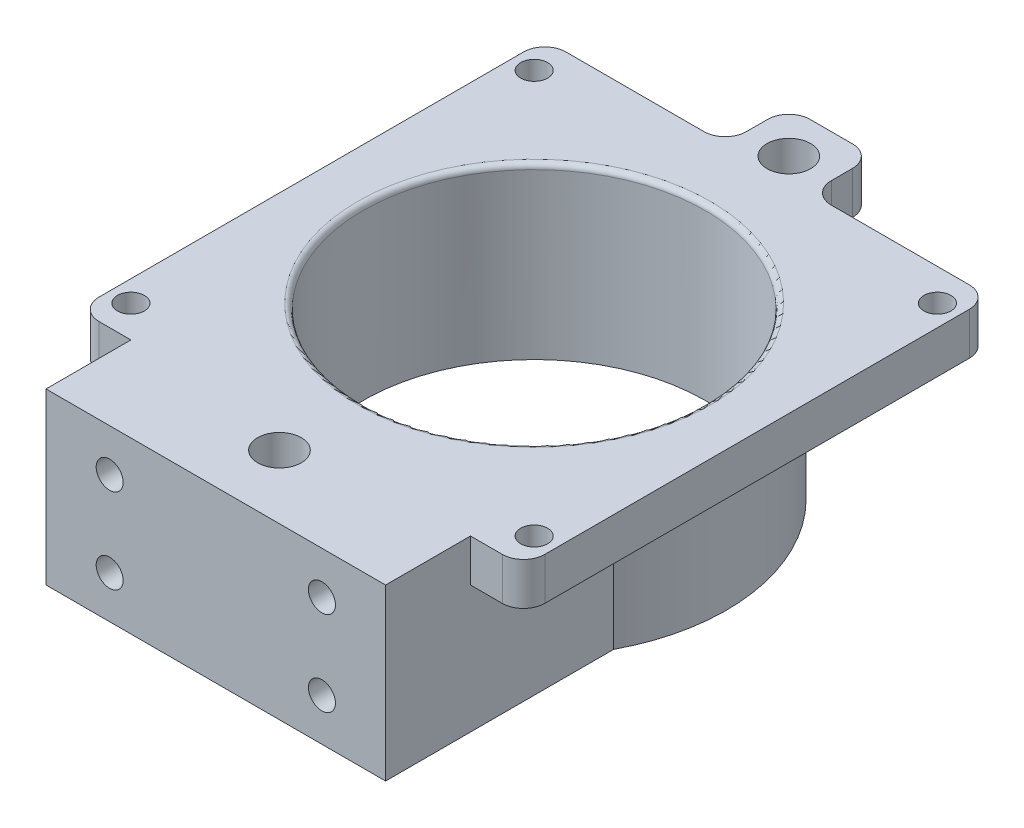
ISO-10303-21;
HEADER;
FILE_DESCRIPTION(('STEP AP214'),'2;1');
FILE_NAME('part.step','',(''),(''),'','','');
FILE_SCHEMA(('AUTOMOTIVE_DESIGN { 1 0 10303 214 1 1 1 1 }'));
ENDSEC;
DATA;
#1=APPLICATION_CONTEXT('core data for automotive mechanical design processes');
#2=APPLICATION_PROTOCOL_DEFINITION('international standard','automotive_design',2000,#1);
#3=PRODUCT_CONTEXT('',#1,'mechanical');
#4=PRODUCT('Part','Part','',(#3));
#5=PRODUCT_RELATED_PRODUCT_CATEGORY('part','',(#4));
#6=PRODUCT_DEFINITION_FORMATION('','',#4);
#7=PRODUCT_DEFINITION_CONTEXT('part definition',#1,'design');
#8=PRODUCT_DEFINITION('design','',#6,#7);
#9=PRODUCT_DEFINITION_SHAPE('','',#8);
#10=(LENGTH_UNIT() NAMED_UNIT(*) SI_UNIT(.MILLI.,.METRE.));
#11=(NAMED_UNIT(*) PLANE_ANGLE_UNIT() SI_UNIT($,.RADIAN.));
#12=(NAMED_UNIT(*) SI_UNIT($,.STERADIAN.) SOLID_ANGLE_UNIT());
#13=UNCERTAINTY_MEASURE_WITH_UNIT(LENGTH_MEASURE(1.E-05),#10,'distance_accuracy_value','');
#14=(GEOMETRIC_REPRESENTATION_CONTEXT(3) GLOBAL_UNCERTAINTY_ASSIGNED_CONTEXT((#13)) GLOBAL_UNIT_ASSIGNED_CONTEXT((#10,
#11,#12)) REPRESENTATION_CONTEXT('',''));
#15=CARTESIAN_POINT('',(0.,0.,0.));
#16=DIRECTION('',(0.,0.,1.));
#17=DIRECTION('',(1.,0.,0.));
#18=AXIS2_PLACEMENT_3D('',#15,#16,#17);
#19=CARTESIAN_POINT('',(25.4,0.,9.525));
#20=DIRECTION('',(1.,0.,0.));
#21=DIRECTION('',(0.,0.,-1.));
#22=AXIS2_PLACEMENT_3D('',#19,#20,#21);
#23=PLANE('',#22);
#24=DIRECTION('',(0.,0.,1.));
#25=VECTOR('',#24,1.);
#26=CARTESIAN_POINT('',(25.4,19.05,9.525));
#27=LINE('',#26,#25);
#28=CARTESIAN_POINT('',(25.4,19.05,13.501629170215));
#29=VERTEX_POINT('',#28);
#30=CARTESIAN_POINT('',(25.4,19.05,34.925));
#31=VERTEX_POINT('',#30);
#32=EDGE_CURVE('E394',#29,#31,#27,.T.);
#33=ORIENTED_EDGE('',*,*,#32,.T.);
#34=DIRECTION('',(0.,1.,0.));
#35=VECTOR('',#34,1.);
#36=CARTESIAN_POINT('',(25.4,0.,34.925));
#37=LINE('',#36,#35);
#38=CARTESIAN_POINT('',(25.4,25.4,34.925));
#39=VERTEX_POINT('',#38);
#40=EDGE_CURVE('E400',#31,#39,#37,.T.);
#41=ORIENTED_EDGE('',*,*,#40,.T.);
#42=DIRECTION('',(0.,0.,1.));
#43=VECTOR('',#42,1.);
#44=CARTESIAN_POINT('',(25.4,25.4,9.525));
#45=LINE('',#44,#43);
#46=CARTESIAN_POINT('',(25.4,25.4,47.625));
#47=VERTEX_POINT('',#46);
#48=EDGE_CURVE('E415',#39,#47,#45,.T.);
#49=ORIENTED_EDGE('',*,*,#48,.T.);
#50=DIRECTION('',(0.,1.,0.));
#51=VECTOR('',#50,1.);
#52=CARTESIAN_POINT('',(25.4,0.,47.625));
#53=LINE('',#52,#51);
#54=CARTESIAN_POINT('',(25.4,0.,47.625));
#55=VERTEX_POINT('',#54);
#56=EDGE_CURVE('E403',#55,#47,#53,.T.);
#57=ORIENTED_EDGE('',*,*,#56,.F.);
#58=DIRECTION('',(0.,0.,1.));
#59=VECTOR('',#58,1.);
#60=CARTESIAN_POINT('',(25.4,0.,9.525));
#61=LINE('',#60,#59);
#62=CARTESIAN_POINT('',(25.4,0.,13.501629170215));
#63=VERTEX_POINT('',#62);
#64=EDGE_CURVE('E50',#63,#55,#61,.T.);
#65=ORIENTED_EDGE('',*,*,#64,.F.);
#66=DIRECTION('',(0.,-1.,0.));
#67=VECTOR('',#66,1.);
#68=CARTESIAN_POINT('',(25.4,19.05,13.501629170215));
#69=LINE('',#68,#67);
#70=EDGE_CURVE('E423',#29,#63,#69,.T.);
#71=ORIENTED_EDGE('',*,*,#70,.F.);
#72=EDGE_LOOP('',(#33,#41,#49,#57,#65,#71));
#73=FACE_BOUND('',#72,.T.);
#74=ADVANCED_FACE('F35',(#73),#23,.T.);
#75=CARTESIAN_POINT('',(-25.4,0.,9.525));
#76=DIRECTION('',(-1.,0.,0.));
#77=DIRECTION('',(0.,0.,1.));
#78=AXIS2_PLACEMENT_3D('',#75,#76,#77);
#79=PLANE('',#78);
#80=DIRECTION('',(0.,0.,1.));
#81=VECTOR('',#80,1.);
#82=CARTESIAN_POINT('',(-25.4,25.4,9.525));
#83=LINE('',#82,#81);
#84=CARTESIAN_POINT('',(-25.4,25.4,34.925));
#85=VERTEX_POINT('',#84);
#86=CARTESIAN_POINT('',(-25.4,25.4,47.625));
#87=VERTEX_POINT('',#86);
#88=EDGE_CURVE('E419',#85,#87,#83,.T.);
#89=ORIENTED_EDGE('',*,*,#88,.F.);
#90=DIRECTION('',(0.,-1.,0.));
#91=VECTOR('',#90,1.);
#92=CARTESIAN_POINT('',(-25.4,0.,34.925));
#93=LINE('',#92,#91);
#94=CARTESIAN_POINT('',(-25.4,19.05,34.925));
#95=VERTEX_POINT('',#94);
#96=EDGE_CURVE('E397',#85,#95,#93,.T.);
#97=ORIENTED_EDGE('',*,*,#96,.T.);
#98=DIRECTION('',(0.,0.,-1.));
#99=VECTOR('',#98,1.);
#100=CARTESIAN_POINT('',(-25.4,19.05,9.525));
#101=LINE('',#100,#99);
#102=CARTESIAN_POINT('',(-25.4,19.05,13.501629170215));
#103=VERTEX_POINT('',#102);
#104=EDGE_CURVE('E392',#95,#103,#101,.T.);
#105=ORIENTED_EDGE('',*,*,#104,.T.);
#106=DIRECTION('',(0.,-1.,0.));
#107=VECTOR('',#106,1.);
#108=CARTESIAN_POINT('',(-25.4,19.05,13.501629170215));
#109=LINE('',#108,#107);
#110=CARTESIAN_POINT('',(-25.4,0.,13.501629170215));
#111=VERTEX_POINT('',#110);
#112=EDGE_CURVE('E58',#111,#103,#109,.F.);
#113=ORIENTED_EDGE('',*,*,#112,.F.);
#114=DIRECTION('',(0.,0.,1.));
#115=VECTOR('',#114,1.);
#116=CARTESIAN_POINT('',(-25.4,0.,9.525));
#117=LINE('',#116,#115);
#118=CARTESIAN_POINT('',(-25.4,0.,47.625));
#119=VERTEX_POINT('',#118);
#120=EDGE_CURVE('E417',#111,#119,#117,.T.);
#121=ORIENTED_EDGE('',*,*,#120,.T.);
#122=DIRECTION('',(0.,-1.,0.));
#123=VECTOR('',#122,1.);
#124=CARTESIAN_POINT('',(-25.4,0.,47.625));
#125=LINE('',#124,#123);
#126=EDGE_CURVE('E409',#87,#119,#125,.T.);
#127=ORIENTED_EDGE('',*,*,#126,.F.);
#128=EDGE_LOOP('',(#89,#97,#105,#113,#121,#127));
#129=FACE_BOUND('',#128,.T.);
#130=ADVANCED_FACE('F449',(#129),#79,.T.);
#131=CARTESIAN_POINT('',(0.,19.05,0.));
#132=DIRECTION('',(0.,-1.,0.));
#133=DIRECTION('',(0.,0.,-1.));
#134=AXIS2_PLACEMENT_3D('',#131,#132,#133);
#135=CYLINDRICAL_SURFACE('',#134,28.7655);
#136=CARTESIAN_POINT('',(0.,19.05,0.));
#137=DIRECTION('',(0.,1.,0.));
#138=DIRECTION('',(0.,0.,1.));
#139=AXIS2_PLACEMENT_3D('',#136,#137,#138);
#140=CIRCLE('',#139,28.7655);
#141=EDGE_CURVE('E426',#29,#103,#140,.T.);
#142=ORIENTED_EDGE('',*,*,#141,.F.);
#143=ORIENTED_EDGE('',*,*,#70,.T.);
#144=CARTESIAN_POINT('',(0.,0.,0.));
#145=DIRECTION('',(0.,1.,0.));
#146=DIRECTION('',(0.,0.,1.));
#147=AXIS2_PLACEMENT_3D('',#144,#145,#146);
#148=CIRCLE('',#147,28.7655);
#149=EDGE_CURVE('E425',#63,#111,#148,.T.);
#150=ORIENTED_EDGE('',*,*,#149,.T.);
#151=ORIENTED_EDGE('',*,*,#112,.T.);
#152=EDGE_LOOP('',(#142,#143,#150,#151));
#153=FACE_BOUND('',#152,.T.);
#154=ADVANCED_FACE('F454',(#153),#135,.T.);
#155=CARTESIAN_POINT('',(0.,0.,0.));
#156=DIRECTION('',(0.,1.,0.));
#157=DIRECTION('',(0.,0.,1.));
#158=AXIS2_PLACEMENT_3D('',#155,#156,#157);
#159=PLANE('',#158);
#160=CARTESIAN_POINT('',(0.,0.,38.1));
#161=DIRECTION('',(0.,1.,0.));
#162=DIRECTION('',(0.,0.,1.));
#163=AXIS2_PLACEMENT_3D('',#160,#161,#162);
#164=CIRCLE('',#163,3.2639);
#165=CARTESIAN_POINT('',(0.,0.,41.3639));
#166=VERTEX_POINT('',#165);
#167=EDGE_CURVE('E238',#166,#166,#164,.T.);
#168=ORIENTED_EDGE('',*,*,#167,.T.);
#169=EDGE_LOOP('',(#168));
#170=FACE_BOUND('',#169,.T.);
#171=CARTESIAN_POINT('',(0.,0.,0.));
#172=DIRECTION('',(0.,1.,0.));
#173=DIRECTION('',(0.,0.,1.));
#174=AXIS2_PLACEMENT_3D('',#171,#172,#173);
#175=CIRCLE('',#174,25.5905);
#176=CARTESIAN_POINT('',(0.,0.,25.5905));
#177=VERTEX_POINT('',#176);
#178=EDGE_CURVE('E265',#177,#177,#175,.T.);
#179=ORIENTED_EDGE('',*,*,#178,.T.);
#180=EDGE_LOOP('',(#179));
#181=FACE_BOUND('',#180,.T.);
#182=ORIENTED_EDGE('',*,*,#149,.F.);
#183=ORIENTED_EDGE('',*,*,#64,.T.);
#184=DIRECTION('',(1.,0.,0.));
#185=VECTOR('',#184,1.);
#186=CARTESIAN_POINT('',(25.4,0.,47.625));
#187=LINE('',#186,#185);
#188=EDGE_CURVE('E412',#119,#55,#187,.T.);
#189=ORIENTED_EDGE('',*,*,#188,.F.);
#190=ORIENTED_EDGE('',*,*,#120,.F.);
#191=EDGE_LOOP('',(#182,#183,#189,#190));
#192=FACE_BOUND('',#191,.T.);
#193=ADVANCED_FACE('F459',(#170,#181,#192),#159,.F.);
#194=CARTESIAN_POINT('',(25.4,25.4,9.525));
#195=DIRECTION('',(0.,1.,0.));
#196=DIRECTION('',(-1.,0.,0.));
#197=AXIS2_PLACEMENT_3D('',#194,#195,#196);
#198=PLANE('',#197);
#199=CARTESIAN_POINT('',(0.,25.4,-38.1));
#200=DIRECTION('',(0.,1.,0.));
#201=DIRECTION('',(0.,0.,1.));
#202=AXIS2_PLACEMENT_3D('',#199,#200,#201);
#203=CIRCLE('',#202,3.2639);
#204=CARTESIAN_POINT('',(0.,25.4,-34.8361));
#205=VERTEX_POINT('',#204);
#206=EDGE_CURVE('E229',#205,#205,#203,.T.);
#207=ORIENTED_EDGE('',*,*,#206,.F.);
#208=EDGE_LOOP('',(#207));
#209=FACE_BOUND('',#208,.T.);
#210=CARTESIAN_POINT('',(0.,25.4,38.1));
#211=DIRECTION('',(0.,1.,0.));
#212=DIRECTION('',(0.,0.,1.));
#213=AXIS2_PLACEMENT_3D('',#210,#211,#212);
#214=CIRCLE('',#213,3.2639);
#215=CARTESIAN_POINT('',(0.,25.4,41.3639));
#216=VERTEX_POINT('',#215);
#217=EDGE_CURVE('E235',#216,#216,#214,.T.);
#218=ORIENTED_EDGE('',*,*,#217,.F.);
#219=EDGE_LOOP('',(#218));
#220=FACE_BOUND('',#219,.T.);
#221=CARTESIAN_POINT('',(-30.1625,25.4,-30.1625));
#222=DIRECTION('',(0.,1.,0.));
#223=DIRECTION('',(0.,0.,1.));
#224=AXIS2_PLACEMENT_3D('',#221,#222,#223);
#225=CIRCLE('',#224,2.0193);
#226=CARTESIAN_POINT('',(-30.1625,25.4,-28.1432));
#227=VERTEX_POINT('',#226);
#228=EDGE_CURVE('E241',#227,#227,#225,.T.);
#229=ORIENTED_EDGE('',*,*,#228,.F.);
#230=EDGE_LOOP('',(#229));
#231=FACE_BOUND('',#230,.T.);
#232=CARTESIAN_POINT('',(30.1625,25.4,-30.1625));
#233=DIRECTION('',(0.,1.,0.));
#234=DIRECTION('',(0.,0.,1.));
#235=AXIS2_PLACEMENT_3D('',#232,#233,#234);
#236=CIRCLE('',#235,2.0193);
#237=CARTESIAN_POINT('',(30.1625,25.4,-28.1432));
#238=VERTEX_POINT('',#237);
#239=EDGE_CURVE('E247',#238,#238,#236,.T.);
#240=ORIENTED_EDGE('',*,*,#239,.F.);
#241=EDGE_LOOP('',(#240));
#242=FACE_BOUND('',#241,.T.);
#243=CARTESIAN_POINT('',(30.1625,25.4,30.1625));
#244=DIRECTION('',(0.,1.,0.));
#245=DIRECTION('',(0.,0.,1.));
#246=AXIS2_PLACEMENT_3D('',#243,#244,#245);
#247=CIRCLE('',#246,2.0193);
#248=CARTESIAN_POINT('',(30.1625,25.4,32.1818));
#249=VERTEX_POINT('',#248);
#250=EDGE_CURVE('E253',#249,#249,#247,.T.);
#251=ORIENTED_EDGE('',*,*,#250,.F.);
#252=EDGE_LOOP('',(#251));
#253=FACE_BOUND('',#252,.T.);
#254=CARTESIAN_POINT('',(-30.1625,25.4,30.1625));
#255=DIRECTION('',(0.,1.,0.));
#256=DIRECTION('',(0.,0.,1.));
#257=AXIS2_PLACEMENT_3D('',#254,#255,#256);
#258=CIRCLE('',#257,2.0193);
#259=CARTESIAN_POINT('',(-30.1625,25.4,32.1818));
#260=VERTEX_POINT('',#259);
#261=EDGE_CURVE('E259',#260,#260,#258,.T.);
#262=ORIENTED_EDGE('',*,*,#261,.F.);
#263=EDGE_LOOP('',(#262));
#264=FACE_BOUND('',#263,.T.);
#265=CARTESIAN_POINT('',(0.,25.4,0.));
#266=DIRECTION('',(0.,1.,0.));
#267=DIRECTION('',(-1.,0.,0.));
#268=AXIS2_PLACEMENT_3D('',#265,#266,#267);
#269=CIRCLE('',#268,26.38425);
#270=CARTESIAN_POINT('',(-26.38425,25.4,0.));
#271=VERTEX_POINT('',#270);
#272=EDGE_CURVE('E11',#271,#271,#269,.F.);
#273=ORIENTED_EDGE('',*,*,#272,.T.);
#274=EDGE_LOOP('',(#273));
#275=FACE_BOUND('',#274,.T.);
#276=ORIENTED_EDGE('',*,*,#48,.F.);
#277=DIRECTION('',(1.,0.,0.));
#278=VECTOR('',#277,1.);
#279=CARTESIAN_POINT('',(-33.3375,25.4,34.925));
#280=LINE('',#279,#278);
#281=CARTESIAN_POINT('',(30.1625,25.4,34.925));
#282=VERTEX_POINT('',#281);
#283=EDGE_CURVE('E291',#39,#282,#280,.T.);
#284=ORIENTED_EDGE('',*,*,#283,.T.);
#285=CARTESIAN_POINT('',(30.1625,25.4,31.75));
#286=DIRECTION('',(0.,1.,0.));
#287=DIRECTION('',(0.,0.,1.));
#288=AXIS2_PLACEMENT_3D('',#285,#286,#287);
#289=CIRCLE('',#288,3.175);
#290=CARTESIAN_POINT('',(33.3375,25.4,31.75));
#291=VERTEX_POINT('',#290);
#292=EDGE_CURVE('E350',#282,#291,#289,.T.);
#293=ORIENTED_EDGE('',*,*,#292,.T.);
#294=DIRECTION('',(0.,0.,-1.));
#295=VECTOR('',#294,1.);
#296=CARTESIAN_POINT('',(33.3375,25.4,-34.925));
#297=LINE('',#296,#295);
#298=CARTESIAN_POINT('',(33.3375,25.4,-31.75));
#299=VERTEX_POINT('',#298);
#300=EDGE_CURVE('E269',#291,#299,#297,.T.);
#301=ORIENTED_EDGE('',*,*,#300,.T.);
#302=CARTESIAN_POINT('',(30.1625,25.4,-31.75));
#303=DIRECTION('',(0.,1.,0.));
#304=DIRECTION('',(0.,0.,1.));
#305=AXIS2_PLACEMENT_3D('',#302,#303,#304);
#306=CIRCLE('',#305,3.175);
#307=CARTESIAN_POINT('',(30.1625,25.4,-34.925));
#308=VERTEX_POINT('',#307);
#309=EDGE_CURVE('E348',#299,#308,#306,.T.);
#310=ORIENTED_EDGE('',*,*,#309,.T.);
#311=DIRECTION('',(-1.,0.,0.));
#312=VECTOR('',#311,1.);
#313=CARTESIAN_POINT('',(6.35,25.4,-34.925));
#314=LINE('',#313,#312);
#315=CARTESIAN_POINT('',(9.525,25.4,-34.925));
#316=VERTEX_POINT('',#315);
#317=EDGE_CURVE('E272',#308,#316,#314,.T.);
#318=ORIENTED_EDGE('',*,*,#317,.T.);
#319=CARTESIAN_POINT('',(9.525,25.4,-38.1));
#320=DIRECTION('',(0.,1.,0.));
#321=DIRECTION('',(0.,0.,1.));
#322=AXIS2_PLACEMENT_3D('',#319,#320,#321);
#323=CIRCLE('',#322,3.175);
#324=CARTESIAN_POINT('',(6.35,25.4,-38.1));
#325=VERTEX_POINT('',#324);
#326=EDGE_CURVE('E386',#316,#325,#323,.F.);
#327=ORIENTED_EDGE('',*,*,#326,.T.);
#328=DIRECTION('',(0.,0.,-1.));
#329=VECTOR('',#328,1.);
#330=CARTESIAN_POINT('',(6.35,25.4,-44.45));
#331=LINE('',#330,#329);
#332=CARTESIAN_POINT('',(6.35,25.4,-41.275));
#333=VERTEX_POINT('',#332);
#334=EDGE_CURVE('E276',#325,#333,#331,.T.);
#335=ORIENTED_EDGE('',*,*,#334,.T.);
#336=CARTESIAN_POINT('',(3.175,25.4,-41.275));
#337=DIRECTION('',(0.,1.,0.));
#338=DIRECTION('',(0.,0.,1.));
#339=AXIS2_PLACEMENT_3D('',#336,#337,#338);
#340=CIRCLE('',#339,3.175);
#341=CARTESIAN_POINT('',(3.175,25.4,-44.45));
#342=VERTEX_POINT('',#341);
#343=EDGE_CURVE('E346',#333,#342,#340,.T.);
#344=ORIENTED_EDGE('',*,*,#343,.T.);
#345=DIRECTION('',(-1.,0.,0.));
#346=VECTOR('',#345,1.);
#347=CARTESIAN_POINT('',(-6.35,25.4,-44.45));
#348=LINE('',#347,#346);
#349=CARTESIAN_POINT('',(-3.175,25.4,-44.45));
#350=VERTEX_POINT('',#349);
#351=EDGE_CURVE('E279',#342,#350,#348,.T.);
#352=ORIENTED_EDGE('',*,*,#351,.T.);
#353=CARTESIAN_POINT('',(-3.175,25.4,-41.275));
#354=DIRECTION('',(0.,1.,0.));
#355=DIRECTION('',(0.,0.,1.));
#356=AXIS2_PLACEMENT_3D('',#353,#354,#355);
#357=CIRCLE('',#356,3.175);
#358=CARTESIAN_POINT('',(-6.35,25.4,-41.275));
#359=VERTEX_POINT('',#358);
#360=EDGE_CURVE('E344',#350,#359,#357,.T.);
#361=ORIENTED_EDGE('',*,*,#360,.T.);
#362=DIRECTION('',(0.,0.,1.));
#363=VECTOR('',#362,1.);
#364=CARTESIAN_POINT('',(-6.35,25.4,-44.45));
#365=LINE('',#364,#363);
#366=CARTESIAN_POINT('',(-6.35,25.4,-38.1));
#367=VERTEX_POINT('',#366);
#368=EDGE_CURVE('E282',#359,#367,#365,.T.);
#369=ORIENTED_EDGE('',*,*,#368,.T.);
#370=CARTESIAN_POINT('',(-9.525,25.4,-38.1));
#371=DIRECTION('',(0.,1.,0.));
#372=DIRECTION('',(0.,0.,1.));
#373=AXIS2_PLACEMENT_3D('',#370,#371,#372);
#374=CIRCLE('',#373,3.175);
#375=CARTESIAN_POINT('',(-9.525,25.4,-34.925));
#376=VERTEX_POINT('',#375);
#377=EDGE_CURVE('E390',#367,#376,#374,.F.);
#378=ORIENTED_EDGE('',*,*,#377,.T.);
#379=DIRECTION('',(-1.,0.,0.));
#380=VECTOR('',#379,1.);
#381=CARTESIAN_POINT('',(-33.3375,25.4,-34.925));
#382=LINE('',#381,#380);
#383=CARTESIAN_POINT('',(-30.1625,25.4,-34.925));
#384=VERTEX_POINT('',#383);
#385=EDGE_CURVE('E285',#376,#384,#382,.T.);
#386=ORIENTED_EDGE('',*,*,#385,.T.);
#387=CARTESIAN_POINT('',(-30.1625,25.4,-31.75));
#388=DIRECTION('',(0.,1.,0.));
#389=DIRECTION('',(0.,0.,1.));
#390=AXIS2_PLACEMENT_3D('',#387,#388,#389);
#391=CIRCLE('',#390,3.175);
#392=CARTESIAN_POINT('',(-33.3375,25.4,-31.75));
#393=VERTEX_POINT('',#392);
#394=EDGE_CURVE('E342',#384,#393,#391,.T.);
#395=ORIENTED_EDGE('',*,*,#394,.T.);
#396=DIRECTION('',(0.,0.,1.));
#397=VECTOR('',#396,1.);
#398=CARTESIAN_POINT('',(-33.3375,25.4,-34.925));
#399=LINE('',#398,#397);
#400=CARTESIAN_POINT('',(-33.3375,25.4,31.75));
#401=VERTEX_POINT('',#400);
#402=EDGE_CURVE('E288',#393,#401,#399,.T.);
#403=ORIENTED_EDGE('',*,*,#402,.T.);
#404=CARTESIAN_POINT('',(-30.1625,25.4,31.75));
#405=DIRECTION('',(0.,1.,0.));
#406=DIRECTION('',(0.,0.,1.));
#407=AXIS2_PLACEMENT_3D('',#404,#405,#406);
#408=CIRCLE('',#407,3.175);
#409=CARTESIAN_POINT('',(-30.1625,25.4,34.925));
#410=VERTEX_POINT('',#409);
#411=EDGE_CURVE('E352',#401,#410,#408,.T.);
#412=ORIENTED_EDGE('',*,*,#411,.T.);
#413=EDGE_CURVE('E292',#410,#85,#280,.T.);
#414=ORIENTED_EDGE('',*,*,#413,.T.);
#415=ORIENTED_EDGE('',*,*,#88,.T.);
#416=DIRECTION('',(-1.,0.,0.));
#417=VECTOR('',#416,1.);
#418=CARTESIAN_POINT('',(25.4,25.4,47.625));
#419=LINE('',#418,#417);
#420=EDGE_CURVE('E406',#47,#87,#419,.T.);
#421=ORIENTED_EDGE('',*,*,#420,.F.);
#422=EDGE_LOOP('',(#276,#284,#293,#301,#310,#318,#327,#335,#344,#352,#361,#369,#378,#386,#395,
#403,#412,#414,#415,#421));
#423=FACE_BOUND('',#422,.T.);
#424=ADVANCED_FACE('F458',(#209,#220,#231,#242,#253,#264,#275,#423),#198,.T.);
#425=CARTESIAN_POINT('',(0.,0.,47.625));
#426=DIRECTION('',(0.,0.,1.));
#427=DIRECTION('',(1.,0.,0.));
#428=AXIS2_PLACEMENT_3D('',#425,#426,#427);
#429=PLANE('',#428);
#430=CARTESIAN_POINT('',(-15.875,19.05,47.625));
#431=DIRECTION('',(0.,0.,1.));
#432=DIRECTION('',(1.,0.,0.));
#433=AXIS2_PLACEMENT_3D('',#430,#431,#432);
#434=CIRCLE('',#433,2.01929999999999);
#435=CARTESIAN_POINT('',(-13.8557,19.05,47.625));
#436=VERTEX_POINT('',#435);
#437=EDGE_CURVE('E207',#436,#436,#434,.T.);
#438=ORIENTED_EDGE('',*,*,#437,.F.);
#439=EDGE_LOOP('',(#438));
#440=FACE_BOUND('',#439,.T.);
#441=CARTESIAN_POINT('',(-15.875,6.35,47.625));
#442=DIRECTION('',(0.,0.,1.));
#443=DIRECTION('',(1.,0.,0.));
#444=AXIS2_PLACEMENT_3D('',#441,#442,#443);
#445=CIRCLE('',#444,2.01929999999999);
#446=CARTESIAN_POINT('',(-13.8557,6.35,47.625));
#447=VERTEX_POINT('',#446);
#448=EDGE_CURVE('E206',#447,#447,#445,.T.);
#449=ORIENTED_EDGE('',*,*,#448,.F.);
#450=EDGE_LOOP('',(#449));
#451=FACE_BOUND('',#450,.T.);
#452=CARTESIAN_POINT('',(15.875,6.35000000000001,47.625));
#453=DIRECTION('',(0.,0.,1.));
#454=DIRECTION('',(1.,0.,0.));
#455=AXIS2_PLACEMENT_3D('',#452,#453,#454);
#456=CIRCLE('',#455,2.01929999999999);
#457=CARTESIAN_POINT('',(17.8943,6.35000000000001,47.625));
#458=VERTEX_POINT('',#457);
#459=EDGE_CURVE('E217',#458,#458,#456,.T.);
#460=ORIENTED_EDGE('',*,*,#459,.F.);
#461=EDGE_LOOP('',(#460));
#462=FACE_BOUND('',#461,.T.);
#463=CARTESIAN_POINT('',(15.875,19.05,47.625));
#464=DIRECTION('',(0.,0.,1.));
#465=DIRECTION('',(1.,0.,0.));
#466=AXIS2_PLACEMENT_3D('',#463,#464,#465);
#467=CIRCLE('',#466,2.01929999999999);
#468=CARTESIAN_POINT('',(17.8943,19.05,47.625));
#469=VERTEX_POINT('',#468);
#470=EDGE_CURVE('E223',#469,#469,#467,.T.);
#471=ORIENTED_EDGE('',*,*,#470,.F.);
#472=EDGE_LOOP('',(#471));
#473=FACE_BOUND('',#472,.T.);
#474=ORIENTED_EDGE('',*,*,#56,.T.);
#475=ORIENTED_EDGE('',*,*,#420,.T.);
#476=ORIENTED_EDGE('',*,*,#126,.T.);
#477=ORIENTED_EDGE('',*,*,#188,.T.);
#478=EDGE_LOOP('',(#474,#475,#476,#477));
#479=FACE_BOUND('',#478,.T.);
#480=ADVANCED_FACE('F549',(#440,#451,#462,#473,#479),#429,.T.);
#481=CARTESIAN_POINT('',(-33.3375,25.4,34.925));
#482=DIRECTION('',(0.,0.,-1.));
#483=DIRECTION('',(-1.,0.,0.));
#484=AXIS2_PLACEMENT_3D('',#481,#482,#483);
#485=PLANE('',#484);
#486=ORIENTED_EDGE('',*,*,#40,.F.);
#487=DIRECTION('',(1.,0.,0.));
#488=VECTOR('',#487,1.);
#489=CARTESIAN_POINT('',(-33.3375,19.05,34.925));
#490=LINE('',#489,#488);
#491=CARTESIAN_POINT('',(30.1625,19.05,34.925));
#492=VERTEX_POINT('',#491);
#493=EDGE_CURVE('E316',#31,#492,#490,.T.);
#494=ORIENTED_EDGE('',*,*,#493,.T.);
#495=DIRECTION('',(0.,-1.,0.));
#496=VECTOR('',#495,1.);
#497=CARTESIAN_POINT('',(30.1625,25.4,34.925));
#498=LINE('',#497,#496);
#499=EDGE_CURVE('E295',#492,#282,#498,.F.);
#500=ORIENTED_EDGE('',*,*,#499,.T.);
#501=ORIENTED_EDGE('',*,*,#283,.F.);
#502=EDGE_LOOP('',(#486,#494,#500,#501));
#503=FACE_BOUND('',#502,.T.);
#504=ADVANCED_FACE('F553',(#503),#485,.F.);
#505=CARTESIAN_POINT('',(0.,19.05,0.));
#506=DIRECTION('',(0.,1.,0.));
#507=DIRECTION('',(0.,0.,1.));
#508=AXIS2_PLACEMENT_3D('',#505,#506,#507);
#509=PLANE('',#508);
#510=CARTESIAN_POINT('',(0.,19.05,-38.1));
#511=DIRECTION('',(0.,1.,0.));
#512=DIRECTION('',(0.,0.,1.));
#513=AXIS2_PLACEMENT_3D('',#510,#511,#512);
#514=CIRCLE('',#513,3.2639);
#515=CARTESIAN_POINT('',(0.,19.05,-34.8361));
#516=VERTEX_POINT('',#515);
#517=EDGE_CURVE('E232',#516,#516,#514,.T.);
#518=ORIENTED_EDGE('',*,*,#517,.T.);
#519=EDGE_LOOP('',(#518));
#520=FACE_BOUND('',#519,.T.);
#521=CARTESIAN_POINT('',(-30.1625,19.05,-30.1625));
#522=DIRECTION('',(0.,1.,0.));
#523=DIRECTION('',(0.,0.,1.));
#524=AXIS2_PLACEMENT_3D('',#521,#522,#523);
#525=CIRCLE('',#524,2.0193);
#526=CARTESIAN_POINT('',(-30.1625,19.05,-28.1432));
#527=VERTEX_POINT('',#526);
#528=EDGE_CURVE('E244',#527,#527,#525,.T.);
#529=ORIENTED_EDGE('',*,*,#528,.T.);
#530=EDGE_LOOP('',(#529));
#531=FACE_BOUND('',#530,.T.);
#532=CARTESIAN_POINT('',(30.1625,19.05,-30.1625));
#533=DIRECTION('',(0.,1.,0.));
#534=DIRECTION('',(0.,0.,1.));
#535=AXIS2_PLACEMENT_3D('',#532,#533,#534);
#536=CIRCLE('',#535,2.0193);
#537=CARTESIAN_POINT('',(30.1625,19.05,-28.1432));
#538=VERTEX_POINT('',#537);
#539=EDGE_CURVE('E250',#538,#538,#536,.T.);
#540=ORIENTED_EDGE('',*,*,#539,.T.);
#541=EDGE_LOOP('',(#540));
#542=FACE_BOUND('',#541,.T.);
#543=CARTESIAN_POINT('',(30.1625,19.05,30.1625));
#544=DIRECTION('',(0.,1.,0.));
#545=DIRECTION('',(0.,0.,1.));
#546=AXIS2_PLACEMENT_3D('',#543,#544,#545);
#547=CIRCLE('',#546,2.0193);
#548=CARTESIAN_POINT('',(30.1625,19.05,32.1818));
#549=VERTEX_POINT('',#548);
#550=EDGE_CURVE('E256',#549,#549,#547,.T.);
#551=ORIENTED_EDGE('',*,*,#550,.T.);
#552=EDGE_LOOP('',(#551));
#553=FACE_BOUND('',#552,.T.);
#554=CARTESIAN_POINT('',(-30.1625,19.05,30.1625));
#555=DIRECTION('',(0.,1.,0.));
#556=DIRECTION('',(0.,0.,1.));
#557=AXIS2_PLACEMENT_3D('',#554,#555,#556);
#558=CIRCLE('',#557,2.0193);
#559=CARTESIAN_POINT('',(-30.1625,19.05,32.1818));
#560=VERTEX_POINT('',#559);
#561=EDGE_CURVE('E262',#560,#560,#558,.T.);
#562=ORIENTED_EDGE('',*,*,#561,.T.);
#563=EDGE_LOOP('',(#562));
#564=FACE_BOUND('',#563,.T.);
#565=ORIENTED_EDGE('',*,*,#32,.F.);
#566=ORIENTED_EDGE('',*,*,#141,.T.);
#567=ORIENTED_EDGE('',*,*,#104,.F.);
#568=CARTESIAN_POINT('',(-30.1625,19.05,34.925));
#569=VERTEX_POINT('',#568);
#570=EDGE_CURVE('E273',#569,#95,#490,.T.);
#571=ORIENTED_EDGE('',*,*,#570,.F.);
#572=CARTESIAN_POINT('',(-30.1625,19.05,31.75));
#573=DIRECTION('',(0.,1.,0.));
#574=DIRECTION('',(0.,0.,1.));
#575=AXIS2_PLACEMENT_3D('',#572,#573,#574);
#576=CIRCLE('',#575,3.175);
#577=CARTESIAN_POINT('',(-33.3375,19.05,31.75));
#578=VERTEX_POINT('',#577);
#579=EDGE_CURVE('E335',#569,#578,#576,.F.);
#580=ORIENTED_EDGE('',*,*,#579,.T.);
#581=DIRECTION('',(0.,0.,1.));
#582=VECTOR('',#581,1.);
#583=CARTESIAN_POINT('',(-33.3375,19.05,-34.925));
#584=LINE('',#583,#582);
#585=CARTESIAN_POINT('',(-33.3375,19.05,-31.75));
#586=VERTEX_POINT('',#585);
#587=EDGE_CURVE('E313',#586,#578,#584,.T.);
#588=ORIENTED_EDGE('',*,*,#587,.F.);
#589=CARTESIAN_POINT('',(-30.1625,19.05,-31.75));
#590=DIRECTION('',(0.,1.,0.));
#591=DIRECTION('',(0.,0.,1.));
#592=AXIS2_PLACEMENT_3D('',#589,#590,#591);
#593=CIRCLE('',#592,3.175);
#594=CARTESIAN_POINT('',(-30.1625,19.05,-34.925));
#595=VERTEX_POINT('',#594);
#596=EDGE_CURVE('E324',#586,#595,#593,.F.);
#597=ORIENTED_EDGE('',*,*,#596,.T.);
#598=DIRECTION('',(-1.,0.,0.));
#599=VECTOR('',#598,1.);
#600=CARTESIAN_POINT('',(-33.3375,19.05,-34.925));
#601=LINE('',#600,#599);
#602=CARTESIAN_POINT('',(-9.525,19.05,-34.925));
#603=VERTEX_POINT('',#602);
#604=EDGE_CURVE('E310',#603,#595,#601,.T.);
#605=ORIENTED_EDGE('',*,*,#604,.F.);
#606=CARTESIAN_POINT('',(-9.525,19.05,-38.1));
#607=DIRECTION('',(0.,1.,0.));
#608=DIRECTION('',(0.,0.,1.));
#609=AXIS2_PLACEMENT_3D('',#606,#607,#608);
#610=CIRCLE('',#609,3.175);
#611=CARTESIAN_POINT('',(-6.35,19.05,-38.1));
#612=VERTEX_POINT('',#611);
#613=EDGE_CURVE('E388',#603,#612,#610,.T.);
#614=ORIENTED_EDGE('',*,*,#613,.T.);
#615=DIRECTION('',(0.,0.,1.));
#616=VECTOR('',#615,1.);
#617=CARTESIAN_POINT('',(-6.35,19.05,-44.45));
#618=LINE('',#617,#616);
#619=CARTESIAN_POINT('',(-6.35,19.05,-41.275));
#620=VERTEX_POINT('',#619);
#621=EDGE_CURVE('E307',#620,#612,#618,.T.);
#622=ORIENTED_EDGE('',*,*,#621,.F.);
#623=CARTESIAN_POINT('',(-3.175,19.05,-41.275));
#624=DIRECTION('',(0.,1.,0.));
#625=DIRECTION('',(0.,0.,1.));
#626=AXIS2_PLACEMENT_3D('',#623,#624,#625);
#627=CIRCLE('',#626,3.175);
#628=CARTESIAN_POINT('',(-3.175,19.05,-44.45));
#629=VERTEX_POINT('',#628);
#630=EDGE_CURVE('E326',#620,#629,#627,.F.);
#631=ORIENTED_EDGE('',*,*,#630,.T.);
#632=DIRECTION('',(-1.,0.,0.));
#633=VECTOR('',#632,1.);
#634=CARTESIAN_POINT('',(-6.35,19.05,-44.45));
#635=LINE('',#634,#633);
#636=CARTESIAN_POINT('',(3.175,19.05,-44.45));
#637=VERTEX_POINT('',#636);
#638=EDGE_CURVE('E304',#637,#629,#635,.T.);
#639=ORIENTED_EDGE('',*,*,#638,.F.);
#640=CARTESIAN_POINT('',(3.175,19.05,-41.275));
#641=DIRECTION('',(0.,1.,0.));
#642=DIRECTION('',(0.,0.,1.));
#643=AXIS2_PLACEMENT_3D('',#640,#641,#642);
#644=CIRCLE('',#643,3.175);
#645=CARTESIAN_POINT('',(6.35,19.05,-41.275));
#646=VERTEX_POINT('',#645);
#647=EDGE_CURVE('E328',#637,#646,#644,.F.);
#648=ORIENTED_EDGE('',*,*,#647,.T.);
#649=DIRECTION('',(0.,0.,-1.));
#650=VECTOR('',#649,1.);
#651=CARTESIAN_POINT('',(6.35,19.05,-44.45));
#652=LINE('',#651,#650);
#653=CARTESIAN_POINT('',(6.35,19.05,-38.1));
#654=VERTEX_POINT('',#653);
#655=EDGE_CURVE('E301',#654,#646,#652,.T.);
#656=ORIENTED_EDGE('',*,*,#655,.F.);
#657=CARTESIAN_POINT('',(9.525,19.05,-38.1));
#658=DIRECTION('',(0.,1.,0.));
#659=DIRECTION('',(0.,0.,1.));
#660=AXIS2_PLACEMENT_3D('',#657,#658,#659);
#661=CIRCLE('',#660,3.175);
#662=CARTESIAN_POINT('',(9.525,19.05,-34.925));
#663=VERTEX_POINT('',#662);
#664=EDGE_CURVE('E384',#654,#663,#661,.T.);
#665=ORIENTED_EDGE('',*,*,#664,.T.);
#666=DIRECTION('',(-1.,0.,0.));
#667=VECTOR('',#666,1.);
#668=CARTESIAN_POINT('',(6.35,19.05,-34.925));
#669=LINE('',#668,#667);
#670=CARTESIAN_POINT('',(30.1625,19.05,-34.925));
#671=VERTEX_POINT('',#670);
#672=EDGE_CURVE('E298',#671,#663,#669,.T.);
#673=ORIENTED_EDGE('',*,*,#672,.F.);
#674=CARTESIAN_POINT('',(30.1625,19.05,-31.75));
#675=DIRECTION('',(0.,1.,0.));
#676=DIRECTION('',(0.,0.,1.));
#677=AXIS2_PLACEMENT_3D('',#674,#675,#676);
#678=CIRCLE('',#677,3.175);
#679=CARTESIAN_POINT('',(33.3375,19.05,-31.75));
#680=VERTEX_POINT('',#679);
#681=EDGE_CURVE('E330',#671,#680,#678,.F.);
#682=ORIENTED_EDGE('',*,*,#681,.T.);
#683=DIRECTION('',(0.,0.,-1.));
#684=VECTOR('',#683,1.);
#685=CARTESIAN_POINT('',(33.3375,19.05,-34.925));
#686=LINE('',#685,#684);
#687=CARTESIAN_POINT('',(33.3375,19.05,31.75));
#688=VERTEX_POINT('',#687);
#689=EDGE_CURVE('E268',#688,#680,#686,.T.);
#690=ORIENTED_EDGE('',*,*,#689,.F.);
#691=CARTESIAN_POINT('',(30.1625,19.05,31.75));
#692=DIRECTION('',(0.,1.,0.));
#693=DIRECTION('',(0.,0.,1.));
#694=AXIS2_PLACEMENT_3D('',#691,#692,#693);
#695=CIRCLE('',#694,3.175);
#696=EDGE_CURVE('E332',#688,#492,#695,.F.);
#697=ORIENTED_EDGE('',*,*,#696,.T.);
#698=ORIENTED_EDGE('',*,*,#493,.F.);
#699=EDGE_LOOP('',(#565,#566,#567,#571,#580,#588,#597,#605,#614,#622,#631,#639,#648,#656,#665,
#673,#682,#690,#697,#698));
#700=FACE_BOUND('',#699,.T.);
#701=ADVANCED_FACE('F469',(#520,#531,#542,#553,#564,#700),#509,.F.);
#702=CARTESIAN_POINT('',(33.3375,25.4,-34.925));
#703=DIRECTION('',(-1.,0.,0.));
#704=DIRECTION('',(0.,0.,1.));
#705=AXIS2_PLACEMENT_3D('',#702,#703,#704);
#706=PLANE('',#705);
#707=ORIENTED_EDGE('',*,*,#300,.F.);
#708=DIRECTION('',(0.,-1.,0.));
#709=VECTOR('',#708,1.);
#710=CARTESIAN_POINT('',(33.3375,25.4,31.75));
#711=LINE('',#710,#709);
#712=EDGE_CURVE('E356',#291,#688,#711,.T.);
#713=ORIENTED_EDGE('',*,*,#712,.T.);
#714=ORIENTED_EDGE('',*,*,#689,.T.);
#715=DIRECTION('',(0.,-1.,0.));
#716=VECTOR('',#715,1.);
#717=CARTESIAN_POINT('',(33.3375,25.4,-31.75));
#718=LINE('',#717,#716);
#719=EDGE_CURVE('E354',#680,#299,#718,.F.);
#720=ORIENTED_EDGE('',*,*,#719,.T.);
#721=EDGE_LOOP('',(#707,#713,#714,#720));
#722=FACE_BOUND('',#721,.T.);
#723=ADVANCED_FACE('F541',(#722),#706,.F.);
#724=CARTESIAN_POINT('',(6.35,25.4,-34.925));
#725=DIRECTION('',(0.,0.,1.));
#726=DIRECTION('',(1.,0.,0.));
#727=AXIS2_PLACEMENT_3D('',#724,#725,#726);
#728=PLANE('',#727);
#729=ORIENTED_EDGE('',*,*,#317,.F.);
#730=DIRECTION('',(0.,-1.,0.));
#731=VECTOR('',#730,1.);
#732=CARTESIAN_POINT('',(30.1625,25.4,-34.925));
#733=LINE('',#732,#731);
#734=EDGE_CURVE('E361',#308,#671,#733,.T.);
#735=ORIENTED_EDGE('',*,*,#734,.T.);
#736=ORIENTED_EDGE('',*,*,#672,.T.);
#737=DIRECTION('',(0.,-1.,0.));
#738=VECTOR('',#737,1.);
#739=CARTESIAN_POINT('',(9.525,25.4,-34.925));
#740=LINE('',#739,#738);
#741=EDGE_CURVE('E359',#663,#316,#740,.F.);
#742=ORIENTED_EDGE('',*,*,#741,.T.);
#743=EDGE_LOOP('',(#729,#735,#736,#742));
#744=FACE_BOUND('',#743,.T.);
#745=ADVANCED_FACE('F532',(#744),#728,.F.);
#746=CARTESIAN_POINT('',(6.35,25.4,-44.45));
#747=DIRECTION('',(-1.,0.,0.));
#748=DIRECTION('',(0.,0.,1.));
#749=AXIS2_PLACEMENT_3D('',#746,#747,#748);
#750=PLANE('',#749);
#751=ORIENTED_EDGE('',*,*,#334,.F.);
#752=DIRECTION('',(0.,-1.,0.));
#753=VECTOR('',#752,1.);
#754=CARTESIAN_POINT('',(6.35,19.05,-38.1));
#755=LINE('',#754,#753);
#756=EDGE_CURVE('E366',#325,#654,#755,.T.);
#757=ORIENTED_EDGE('',*,*,#756,.T.);
#758=ORIENTED_EDGE('',*,*,#655,.T.);
#759=DIRECTION('',(0.,-1.,0.));
#760=VECTOR('',#759,1.);
#761=CARTESIAN_POINT('',(6.35,25.4,-41.275));
#762=LINE('',#761,#760);
#763=EDGE_CURVE('E364',#646,#333,#762,.F.);
#764=ORIENTED_EDGE('',*,*,#763,.T.);
#765=EDGE_LOOP('',(#751,#757,#758,#764));
#766=FACE_BOUND('',#765,.T.);
#767=ADVANCED_FACE('F523',(#766),#750,.F.);
#768=CARTESIAN_POINT('',(-6.35,25.4,-44.45));
#769=DIRECTION('',(0.,0.,1.));
#770=DIRECTION('',(1.,0.,0.));
#771=AXIS2_PLACEMENT_3D('',#768,#769,#770);
#772=PLANE('',#771);
#773=ORIENTED_EDGE('',*,*,#351,.F.);
#774=DIRECTION('',(0.,-1.,0.));
#775=VECTOR('',#774,1.);
#776=CARTESIAN_POINT('',(3.175,25.4,-44.45));
#777=LINE('',#776,#775);
#778=EDGE_CURVE('E371',#342,#637,#777,.T.);
#779=ORIENTED_EDGE('',*,*,#778,.T.);
#780=ORIENTED_EDGE('',*,*,#638,.T.);
#781=DIRECTION('',(0.,-1.,0.));
#782=VECTOR('',#781,1.);
#783=CARTESIAN_POINT('',(-3.175,25.4,-44.45));
#784=LINE('',#783,#782);
#785=EDGE_CURVE('E369',#629,#350,#784,.F.);
#786=ORIENTED_EDGE('',*,*,#785,.T.);
#787=EDGE_LOOP('',(#773,#779,#780,#786));
#788=FACE_BOUND('',#787,.T.);
#789=ADVANCED_FACE('F514',(#788),#772,.F.);
#790=CARTESIAN_POINT('',(-6.35,25.4,-44.45));
#791=DIRECTION('',(1.,0.,0.));
#792=DIRECTION('',(0.,0.,-1.));
#793=AXIS2_PLACEMENT_3D('',#790,#791,#792);
#794=PLANE('',#793);
#795=ORIENTED_EDGE('',*,*,#621,.T.);
#796=DIRECTION('',(0.,-1.,0.));
#797=VECTOR('',#796,1.);
#798=CARTESIAN_POINT('',(-6.35,25.4,-38.1));
#799=LINE('',#798,#797);
#800=EDGE_CURVE('E382',#612,#367,#799,.F.);
#801=ORIENTED_EDGE('',*,*,#800,.T.);
#802=ORIENTED_EDGE('',*,*,#368,.F.);
#803=DIRECTION('',(0.,-1.,0.));
#804=VECTOR('',#803,1.);
#805=CARTESIAN_POINT('',(-6.35,25.4,-41.275));
#806=LINE('',#805,#804);
#807=EDGE_CURVE('E379',#359,#620,#806,.T.);
#808=ORIENTED_EDGE('',*,*,#807,.T.);
#809=EDGE_LOOP('',(#795,#801,#802,#808));
#810=FACE_BOUND('',#809,.T.);
#811=ADVANCED_FACE('F504',(#810),#794,.F.);
#812=CARTESIAN_POINT('',(-33.3375,25.4,-34.925));
#813=DIRECTION('',(0.,0.,1.));
#814=DIRECTION('',(1.,0.,0.));
#815=AXIS2_PLACEMENT_3D('',#812,#813,#814);
#816=PLANE('',#815);
#817=ORIENTED_EDGE('',*,*,#385,.F.);
#818=DIRECTION('',(0.,-1.,0.));
#819=VECTOR('',#818,1.);
#820=CARTESIAN_POINT('',(-9.525,19.05,-34.925));
#821=LINE('',#820,#819);
#822=EDGE_CURVE('E376',#376,#603,#821,.T.);
#823=ORIENTED_EDGE('',*,*,#822,.T.);
#824=ORIENTED_EDGE('',*,*,#604,.T.);
#825=DIRECTION('',(0.,-1.,0.));
#826=VECTOR('',#825,1.);
#827=CARTESIAN_POINT('',(-30.1625,25.4,-34.925));
#828=LINE('',#827,#826);
#829=EDGE_CURVE('E374',#595,#384,#828,.F.);
#830=ORIENTED_EDGE('',*,*,#829,.T.);
#831=EDGE_LOOP('',(#817,#823,#824,#830));
#832=FACE_BOUND('',#831,.T.);
#833=ADVANCED_FACE('F496',(#832),#816,.F.);
#834=CARTESIAN_POINT('',(-33.3375,25.4,-34.925));
#835=DIRECTION('',(1.,0.,0.));
#836=DIRECTION('',(0.,0.,-1.));
#837=AXIS2_PLACEMENT_3D('',#834,#835,#836);
#838=PLANE('',#837);
#839=ORIENTED_EDGE('',*,*,#587,.T.);
#840=DIRECTION('',(0.,-1.,0.));
#841=VECTOR('',#840,1.);
#842=CARTESIAN_POINT('',(-33.3375,25.4,31.75));
#843=LINE('',#842,#841);
#844=EDGE_CURVE('E340',#578,#401,#843,.F.);
#845=ORIENTED_EDGE('',*,*,#844,.T.);
#846=ORIENTED_EDGE('',*,*,#402,.F.);
#847=DIRECTION('',(0.,-1.,0.));
#848=VECTOR('',#847,1.);
#849=CARTESIAN_POINT('',(-33.3375,25.4,-31.75));
#850=LINE('',#849,#848);
#851=EDGE_CURVE('E337',#393,#586,#850,.T.);
#852=ORIENTED_EDGE('',*,*,#851,.T.);
#853=EDGE_LOOP('',(#839,#845,#846,#852));
#854=FACE_BOUND('',#853,.T.);
#855=ADVANCED_FACE('F488',(#854),#838,.F.);
#856=ORIENTED_EDGE('',*,*,#96,.F.);
#857=ORIENTED_EDGE('',*,*,#413,.F.);
#858=DIRECTION('',(0.,-1.,0.));
#859=VECTOR('',#858,1.);
#860=CARTESIAN_POINT('',(-30.1625,25.4,34.925));
#861=LINE('',#860,#859);
#862=EDGE_CURVE('E321',#410,#569,#861,.T.);
#863=ORIENTED_EDGE('',*,*,#862,.T.);
#864=ORIENTED_EDGE('',*,*,#570,.T.);
#865=EDGE_LOOP('',(#856,#857,#863,#864));
#866=FACE_BOUND('',#865,.T.);
#867=ADVANCED_FACE('F476',(#866),#485,.F.);
#868=CARTESIAN_POINT('',(-30.1625,25.4,31.75));
#869=DIRECTION('',(0.,-1.,0.));
#870=DIRECTION('',(0.,0.,-1.));
#871=AXIS2_PLACEMENT_3D('',#868,#869,#870);
#872=CYLINDRICAL_SURFACE('',#871,3.175);
#873=ORIENTED_EDGE('',*,*,#411,.F.);
#874=ORIENTED_EDGE('',*,*,#844,.F.);
#875=ORIENTED_EDGE('',*,*,#579,.F.);
#876=ORIENTED_EDGE('',*,*,#862,.F.);
#877=EDGE_LOOP('',(#873,#874,#875,#876));
#878=FACE_BOUND('',#877,.T.);
#879=ADVANCED_FACE('F485',(#878),#872,.T.);
#880=CARTESIAN_POINT('',(30.1625,25.4,31.75));
#881=DIRECTION('',(0.,-1.,0.));
#882=DIRECTION('',(0.,0.,-1.));
#883=AXIS2_PLACEMENT_3D('',#880,#881,#882);
#884=CYLINDRICAL_SURFACE('',#883,3.175);
#885=ORIENTED_EDGE('',*,*,#292,.F.);
#886=ORIENTED_EDGE('',*,*,#499,.F.);
#887=ORIENTED_EDGE('',*,*,#696,.F.);
#888=ORIENTED_EDGE('',*,*,#712,.F.);
#889=EDGE_LOOP('',(#885,#886,#887,#888));
#890=FACE_BOUND('',#889,.T.);
#891=ADVANCED_FACE('F545',(#890),#884,.T.);
#892=CARTESIAN_POINT('',(30.1625,25.4,-31.75));
#893=DIRECTION('',(0.,-1.,0.));
#894=DIRECTION('',(0.,0.,-1.));
#895=AXIS2_PLACEMENT_3D('',#892,#893,#894);
#896=CYLINDRICAL_SURFACE('',#895,3.175);
#897=ORIENTED_EDGE('',*,*,#309,.F.);
#898=ORIENTED_EDGE('',*,*,#719,.F.);
#899=ORIENTED_EDGE('',*,*,#681,.F.);
#900=ORIENTED_EDGE('',*,*,#734,.F.);
#901=EDGE_LOOP('',(#897,#898,#899,#900));
#902=FACE_BOUND('',#901,.T.);
#903=ADVANCED_FACE('F536',(#902),#896,.T.);
#904=CARTESIAN_POINT('',(9.525,25.4,-38.1));
#905=DIRECTION('',(0.,1.,0.));
#906=DIRECTION('',(0.,0.,1.));
#907=AXIS2_PLACEMENT_3D('',#904,#905,#906);
#908=CYLINDRICAL_SURFACE('',#907,3.175);
#909=ORIENTED_EDGE('',*,*,#326,.F.);
#910=ORIENTED_EDGE('',*,*,#741,.F.);
#911=ORIENTED_EDGE('',*,*,#664,.F.);
#912=ORIENTED_EDGE('',*,*,#756,.F.);
#913=EDGE_LOOP('',(#909,#910,#911,#912));
#914=FACE_BOUND('',#913,.T.);
#915=ADVANCED_FACE('F527',(#914),#908,.F.);
#916=CARTESIAN_POINT('',(3.175,25.4,-41.275));
#917=DIRECTION('',(0.,-1.,0.));
#918=DIRECTION('',(0.,0.,-1.));
#919=AXIS2_PLACEMENT_3D('',#916,#917,#918);
#920=CYLINDRICAL_SURFACE('',#919,3.175);
#921=ORIENTED_EDGE('',*,*,#343,.F.);
#922=ORIENTED_EDGE('',*,*,#763,.F.);
#923=ORIENTED_EDGE('',*,*,#647,.F.);
#924=ORIENTED_EDGE('',*,*,#778,.F.);
#925=EDGE_LOOP('',(#921,#922,#923,#924));
#926=FACE_BOUND('',#925,.T.);
#927=ADVANCED_FACE('F518',(#926),#920,.T.);
#928=CARTESIAN_POINT('',(-9.525,25.4,-38.1));
#929=DIRECTION('',(0.,1.,0.));
#930=DIRECTION('',(0.,0.,1.));
#931=AXIS2_PLACEMENT_3D('',#928,#929,#930);
#932=CYLINDRICAL_SURFACE('',#931,3.175);
#933=ORIENTED_EDGE('',*,*,#377,.F.);
#934=ORIENTED_EDGE('',*,*,#800,.F.);
#935=ORIENTED_EDGE('',*,*,#613,.F.);
#936=ORIENTED_EDGE('',*,*,#822,.F.);
#937=EDGE_LOOP('',(#933,#934,#935,#936));
#938=FACE_BOUND('',#937,.T.);
#939=ADVANCED_FACE('F500',(#938),#932,.F.);
#940=CARTESIAN_POINT('',(-3.175,25.4,-41.275));
#941=DIRECTION('',(0.,-1.,0.));
#942=DIRECTION('',(0.,0.,-1.));
#943=AXIS2_PLACEMENT_3D('',#940,#941,#942);
#944=CYLINDRICAL_SURFACE('',#943,3.175);
#945=ORIENTED_EDGE('',*,*,#360,.F.);
#946=ORIENTED_EDGE('',*,*,#785,.F.);
#947=ORIENTED_EDGE('',*,*,#630,.F.);
#948=ORIENTED_EDGE('',*,*,#807,.F.);
#949=EDGE_LOOP('',(#945,#946,#947,#948));
#950=FACE_BOUND('',#949,.T.);
#951=ADVANCED_FACE('F509',(#950),#944,.T.);
#952=CARTESIAN_POINT('',(-30.1625,25.4,-31.75));
#953=DIRECTION('',(0.,-1.,0.));
#954=DIRECTION('',(0.,0.,-1.));
#955=AXIS2_PLACEMENT_3D('',#952,#953,#954);
#956=CYLINDRICAL_SURFACE('',#955,3.175);
#957=ORIENTED_EDGE('',*,*,#394,.F.);
#958=ORIENTED_EDGE('',*,*,#829,.F.);
#959=ORIENTED_EDGE('',*,*,#596,.F.);
#960=ORIENTED_EDGE('',*,*,#851,.F.);
#961=EDGE_LOOP('',(#957,#958,#959,#960));
#962=FACE_BOUND('',#961,.T.);
#963=ADVANCED_FACE('F445',(#962),#956,.T.);
#964=CARTESIAN_POINT('',(0.,0.,0.));
#965=DIRECTION('',(0.,1.,0.));
#966=DIRECTION('',(0.,0.,1.));
#967=AXIS2_PLACEMENT_3D('',#964,#965,#966);
#968=CYLINDRICAL_SURFACE('',#967,25.5905);
#969=CARTESIAN_POINT('',(0.,24.60625,0.));
#970=DIRECTION('',(0.,1.,0.));
#971=DIRECTION('',(-1.,0.,0.));
#972=AXIS2_PLACEMENT_3D('',#969,#970,#971);
#973=CIRCLE('',#972,25.5905);
#974=CARTESIAN_POINT('',(-25.5905,24.60625,0.));
#975=VERTEX_POINT('',#974);
#976=EDGE_CURVE('E43',#975,#975,#973,.T.);
#977=ORIENTED_EDGE('',*,*,#976,.T.);
#978=EDGE_LOOP('',(#977));
#979=FACE_BOUND('',#978,.T.);
#980=ORIENTED_EDGE('',*,*,#178,.F.);
#981=EDGE_LOOP('',(#980));
#982=FACE_BOUND('',#981,.T.);
#983=ADVANCED_FACE('F432',(#979,#982),#968,.F.);
#984=CARTESIAN_POINT('',(0.,24.60625,0.));
#985=DIRECTION('',(0.,1.,0.));
#986=DIRECTION('',(-1.,0.,0.));
#987=AXIS2_PLACEMENT_3D('',#984,#985,#986);
#988=TOROIDAL_SURFACE('',#987,26.38425,0.79375);
#989=ORIENTED_EDGE('',*,*,#272,.F.);
#990=EDGE_LOOP('',(#989));
#991=FACE_BOUND('',#990,.T.);
#992=ORIENTED_EDGE('',*,*,#976,.F.);
#993=EDGE_LOOP('',(#992));
#994=FACE_BOUND('',#993,.T.);
#995=ADVANCED_FACE('F37',(#991,#994),#988,.T.);
#996=CARTESIAN_POINT('',(-30.1625,25.4,30.1625));
#997=DIRECTION('',(0.,1.,0.));
#998=DIRECTION('',(0.,0.,1.));
#999=AXIS2_PLACEMENT_3D('',#996,#997,#998);
#1000=CYLINDRICAL_SURFACE('',#999,2.0193);
#1001=ORIENTED_EDGE('',*,*,#561,.F.);
#1002=EDGE_LOOP('',(#1001));
#1003=FACE_BOUND('',#1002,.T.);
#1004=ORIENTED_EDGE('',*,*,#261,.T.);
#1005=EDGE_LOOP('',(#1004));
#1006=FACE_BOUND('',#1005,.T.);
#1007=ADVANCED_FACE('F436',(#1003,#1006),#1000,.F.);
#1008=CARTESIAN_POINT('',(30.1625,25.4,30.1625));
#1009=DIRECTION('',(0.,1.,0.));
#1010=DIRECTION('',(0.,0.,1.));
#1011=AXIS2_PLACEMENT_3D('',#1008,#1009,#1010);
#1012=CYLINDRICAL_SURFACE('',#1011,2.0193);
#1013=ORIENTED_EDGE('',*,*,#550,.F.);
#1014=EDGE_LOOP('',(#1013));
#1015=FACE_BOUND('',#1014,.T.);
#1016=ORIENTED_EDGE('',*,*,#250,.T.);
#1017=EDGE_LOOP('',(#1016));
#1018=FACE_BOUND('',#1017,.T.);
#1019=ADVANCED_FACE('F442',(#1015,#1018),#1012,.F.);
#1020=CARTESIAN_POINT('',(30.1625,25.4,-30.1625));
#1021=DIRECTION('',(0.,1.,0.));
#1022=DIRECTION('',(0.,0.,1.));
#1023=AXIS2_PLACEMENT_3D('',#1020,#1021,#1022);
#1024=CYLINDRICAL_SURFACE('',#1023,2.0193);
#1025=ORIENTED_EDGE('',*,*,#539,.F.);
#1026=EDGE_LOOP('',(#1025));
#1027=FACE_BOUND('',#1026,.T.);
#1028=ORIENTED_EDGE('',*,*,#239,.T.);
#1029=EDGE_LOOP('',(#1028));
#1030=FACE_BOUND('',#1029,.T.);
#1031=ADVANCED_FACE('F601',(#1027,#1030),#1024,.F.);
#1032=CARTESIAN_POINT('',(-30.1625,25.4,-30.1625));
#1033=DIRECTION('',(0.,1.,0.));
#1034=DIRECTION('',(0.,0.,1.));
#1035=AXIS2_PLACEMENT_3D('',#1032,#1033,#1034);
#1036=CYLINDRICAL_SURFACE('',#1035,2.0193);
#1037=ORIENTED_EDGE('',*,*,#528,.F.);
#1038=EDGE_LOOP('',(#1037));
#1039=FACE_BOUND('',#1038,.T.);
#1040=ORIENTED_EDGE('',*,*,#228,.T.);
#1041=EDGE_LOOP('',(#1040));
#1042=FACE_BOUND('',#1041,.T.);
#1043=ADVANCED_FACE('F605',(#1039,#1042),#1036,.F.);
#1044=CARTESIAN_POINT('',(0.,25.4,38.1));
#1045=DIRECTION('',(0.,1.,0.));
#1046=DIRECTION('',(0.,0.,1.));
#1047=AXIS2_PLACEMENT_3D('',#1044,#1045,#1046);
#1048=CYLINDRICAL_SURFACE('',#1047,3.2639);
#1049=ORIENTED_EDGE('',*,*,#167,.F.);
#1050=EDGE_LOOP('',(#1049));
#1051=FACE_BOUND('',#1050,.T.);
#1052=ORIENTED_EDGE('',*,*,#217,.T.);
#1053=EDGE_LOOP('',(#1052));
#1054=FACE_BOUND('',#1053,.T.);
#1055=ADVANCED_FACE('F609',(#1051,#1054),#1048,.F.);
#1056=CARTESIAN_POINT('',(0.,25.4,-38.1));
#1057=DIRECTION('',(0.,1.,0.));
#1058=DIRECTION('',(0.,0.,1.));
#1059=AXIS2_PLACEMENT_3D('',#1056,#1057,#1058);
#1060=CYLINDRICAL_SURFACE('',#1059,3.2639);
#1061=ORIENTED_EDGE('',*,*,#517,.F.);
#1062=EDGE_LOOP('',(#1061));
#1063=FACE_BOUND('',#1062,.T.);
#1064=ORIENTED_EDGE('',*,*,#206,.T.);
#1065=EDGE_LOOP('',(#1064));
#1066=FACE_BOUND('',#1065,.T.);
#1067=ADVANCED_FACE('F613',(#1063,#1066),#1060,.F.);
#1068=CARTESIAN_POINT('',(15.875,19.05,30.861));
#1069=DIRECTION('',(0.,0.,1.));
#1070=DIRECTION('',(1.,0.,0.));
#1071=AXIS2_PLACEMENT_3D('',#1068,#1069,#1070);
#1072=CONICAL_SURFACE('',#1071,2.01929999999999,1.02974425867665);
#1073=CARTESIAN_POINT('',(15.875,19.05,29.6476821519976));
#1074=VERTEX_POINT('',#1073);
#1075=VERTEX_LOOP('',#1074);
#1076=FACE_BOUND('',#1075,.T.);
#1077=CARTESIAN_POINT('',(15.875,19.05,30.861));
#1078=DIRECTION('',(0.,0.,1.));
#1079=DIRECTION('',(1.,0.,0.));
#1080=AXIS2_PLACEMENT_3D('',#1077,#1078,#1079);
#1081=CIRCLE('',#1080,2.01929999999999);
#1082=CARTESIAN_POINT('',(17.8943,19.05,30.861));
#1083=VERTEX_POINT('',#1082);
#1084=EDGE_CURVE('E226',#1083,#1083,#1081,.T.);
#1085=ORIENTED_EDGE('',*,*,#1084,.T.);
#1086=EDGE_LOOP('',(#1085));
#1087=FACE_BOUND('',#1086,.T.);
#1088=ADVANCED_FACE('F617',(#1076,#1087),#1072,.F.);
#1089=CARTESIAN_POINT('',(15.875,19.05,47.625));
#1090=DIRECTION('',(0.,0.,1.));
#1091=DIRECTION('',(1.,0.,0.));
#1092=AXIS2_PLACEMENT_3D('',#1089,#1090,#1091);
#1093=CYLINDRICAL_SURFACE('',#1092,2.01929999999999);
#1094=ORIENTED_EDGE('',*,*,#1084,.F.);
#1095=EDGE_LOOP('',(#1094));
#1096=FACE_BOUND('',#1095,.T.);
#1097=ORIENTED_EDGE('',*,*,#470,.T.);
#1098=EDGE_LOOP('',(#1097));
#1099=FACE_BOUND('',#1098,.T.);
#1100=ADVANCED_FACE('F621',(#1096,#1099),#1093,.F.);
#1101=CARTESIAN_POINT('',(15.875,6.35000000000001,30.861));
#1102=DIRECTION('',(0.,0.,1.));
#1103=DIRECTION('',(1.,0.,0.));
#1104=AXIS2_PLACEMENT_3D('',#1101,#1102,#1103);
#1105=CONICAL_SURFACE('',#1104,2.01929999999999,1.02974425867665);
#1106=CARTESIAN_POINT('',(15.875,6.35000000000001,29.6476821519976));
#1107=VERTEX_POINT('',#1106);
#1108=VERTEX_LOOP('',#1107);
#1109=FACE_BOUND('',#1108,.T.);
#1110=CARTESIAN_POINT('',(15.875,6.35000000000001,30.861));
#1111=DIRECTION('',(0.,0.,1.));
#1112=DIRECTION('',(1.,0.,0.));
#1113=AXIS2_PLACEMENT_3D('',#1110,#1111,#1112);
#1114=CIRCLE('',#1113,2.01929999999999);
#1115=CARTESIAN_POINT('',(17.8943,6.35000000000001,30.861));
#1116=VERTEX_POINT('',#1115);
#1117=EDGE_CURVE('E220',#1116,#1116,#1114,.T.);
#1118=ORIENTED_EDGE('',*,*,#1117,.T.);
#1119=EDGE_LOOP('',(#1118));
#1120=FACE_BOUND('',#1119,.T.);
#1121=ADVANCED_FACE('F625',(#1109,#1120),#1105,.F.);
#1122=CARTESIAN_POINT('',(15.875,6.35000000000001,47.625));
#1123=DIRECTION('',(0.,0.,1.));
#1124=DIRECTION('',(1.,0.,0.));
#1125=AXIS2_PLACEMENT_3D('',#1122,#1123,#1124);
#1126=CYLINDRICAL_SURFACE('',#1125,2.01929999999999);
#1127=ORIENTED_EDGE('',*,*,#1117,.F.);
#1128=EDGE_LOOP('',(#1127));
#1129=FACE_BOUND('',#1128,.T.);
#1130=ORIENTED_EDGE('',*,*,#459,.T.);
#1131=EDGE_LOOP('',(#1130));
#1132=FACE_BOUND('',#1131,.T.);
#1133=ADVANCED_FACE('F629',(#1129,#1132),#1126,.F.);
#1134=CARTESIAN_POINT('',(-15.875,6.35,30.861));
#1135=DIRECTION('',(0.,0.,1.));
#1136=DIRECTION('',(1.,0.,0.));
#1137=AXIS2_PLACEMENT_3D('',#1134,#1135,#1136);
#1138=CONICAL_SURFACE('',#1137,2.0193,1.02974425867665);
#1139=CARTESIAN_POINT('',(-15.875,6.35,29.6476821519976));
#1140=VERTEX_POINT('',#1139);
#1141=VERTEX_LOOP('',#1140);
#1142=FACE_BOUND('',#1141,.T.);
#1143=CARTESIAN_POINT('',(-15.875,6.35,30.861));
#1144=DIRECTION('',(0.,0.,1.));
#1145=DIRECTION('',(1.,0.,0.));
#1146=AXIS2_PLACEMENT_3D('',#1143,#1144,#1145);
#1147=CIRCLE('',#1146,2.0193);
#1148=CARTESIAN_POINT('',(-13.8557,6.35,30.861));
#1149=VERTEX_POINT('',#1148);
#1150=EDGE_CURVE('E210',#1149,#1149,#1147,.T.);
#1151=ORIENTED_EDGE('',*,*,#1150,.T.);
#1152=EDGE_LOOP('',(#1151));
#1153=FACE_BOUND('',#1152,.T.);
#1154=ADVANCED_FACE('F633',(#1142,#1153),#1138,.F.);
#1155=CARTESIAN_POINT('',(-15.875,6.35,47.625));
#1156=DIRECTION('',(0.,0.,1.));
#1157=DIRECTION('',(1.,0.,0.));
#1158=AXIS2_PLACEMENT_3D('',#1155,#1156,#1157);
#1159=CYLINDRICAL_SURFACE('',#1158,2.01929999999999);
#1160=ORIENTED_EDGE('',*,*,#1150,.F.);
#1161=EDGE_LOOP('',(#1160));
#1162=FACE_BOUND('',#1161,.T.);
#1163=ORIENTED_EDGE('',*,*,#448,.T.);
#1164=EDGE_LOOP('',(#1163));
#1165=FACE_BOUND('',#1164,.T.);
#1166=ADVANCED_FACE('F200',(#1162,#1165),#1159,.F.);
#1167=CARTESIAN_POINT('',(-15.875,19.05,30.861));
#1168=DIRECTION('',(0.,0.,1.));
#1169=DIRECTION('',(1.,0.,0.));
#1170=AXIS2_PLACEMENT_3D('',#1167,#1168,#1169);
#1171=CONICAL_SURFACE('',#1170,2.0193,1.02974425867665);
#1172=CARTESIAN_POINT('',(-15.875,19.05,29.6476821519976));
#1173=VERTEX_POINT('',#1172);
#1174=VERTEX_LOOP('',#1173);
#1175=FACE_BOUND('',#1174,.T.);
#1176=CARTESIAN_POINT('',(-15.875,19.05,30.861));
#1177=DIRECTION('',(0.,0.,1.));
#1178=DIRECTION('',(1.,0.,0.));
#1179=AXIS2_PLACEMENT_3D('',#1176,#1177,#1178);
#1180=CIRCLE('',#1179,2.0193);
#1181=CARTESIAN_POINT('',(-13.8557,19.05,30.861));
#1182=VERTEX_POINT('',#1181);
#1183=EDGE_CURVE('E204',#1182,#1182,#1180,.T.);
#1184=ORIENTED_EDGE('',*,*,#1183,.T.);
#1185=EDGE_LOOP('',(#1184));
#1186=FACE_BOUND('',#1185,.T.);
#1187=ADVANCED_FACE('F196',(#1175,#1186),#1171,.F.);
#1188=CARTESIAN_POINT('',(-15.875,19.05,47.625));
#1189=DIRECTION('',(0.,0.,1.));
#1190=DIRECTION('',(1.,0.,0.));
#1191=AXIS2_PLACEMENT_3D('',#1188,#1189,#1190);
#1192=CYLINDRICAL_SURFACE('',#1191,2.01929999999999);
#1193=ORIENTED_EDGE('',*,*,#1183,.F.);
#1194=EDGE_LOOP('',(#1193));
#1195=FACE_BOUND('',#1194,.T.);
#1196=ORIENTED_EDGE('',*,*,#437,.T.);
#1197=EDGE_LOOP('',(#1196));
#1198=FACE_BOUND('',#1197,.T.);
#1199=ADVANCED_FACE('F199',(#1195,#1198),#1192,.F.);
#1200=CLOSED_SHELL('',(#74,#130,#154,#193,#424,#480,#504,#701,#723,#745,#767,#789,#811,#833,
#855,#867,#879,#891,#903,#915,#927,#939,#951,#963,#983,#995,#1007,#1019,#1031,#1043,#1055,#1067,
#1088,#1100,#1121,#1133,#1154,#1166,#1187,#1199));
#1201=MANIFOLD_SOLID_BREP('B2',#1200);
#1202=ADVANCED_BREP_SHAPE_REPRESENTATION('',(#18,#1201),#14);
#1203=SHAPE_DEFINITION_REPRESENTATION(#9,#1202);
ENDSEC;
END-ISO-10303-21;
